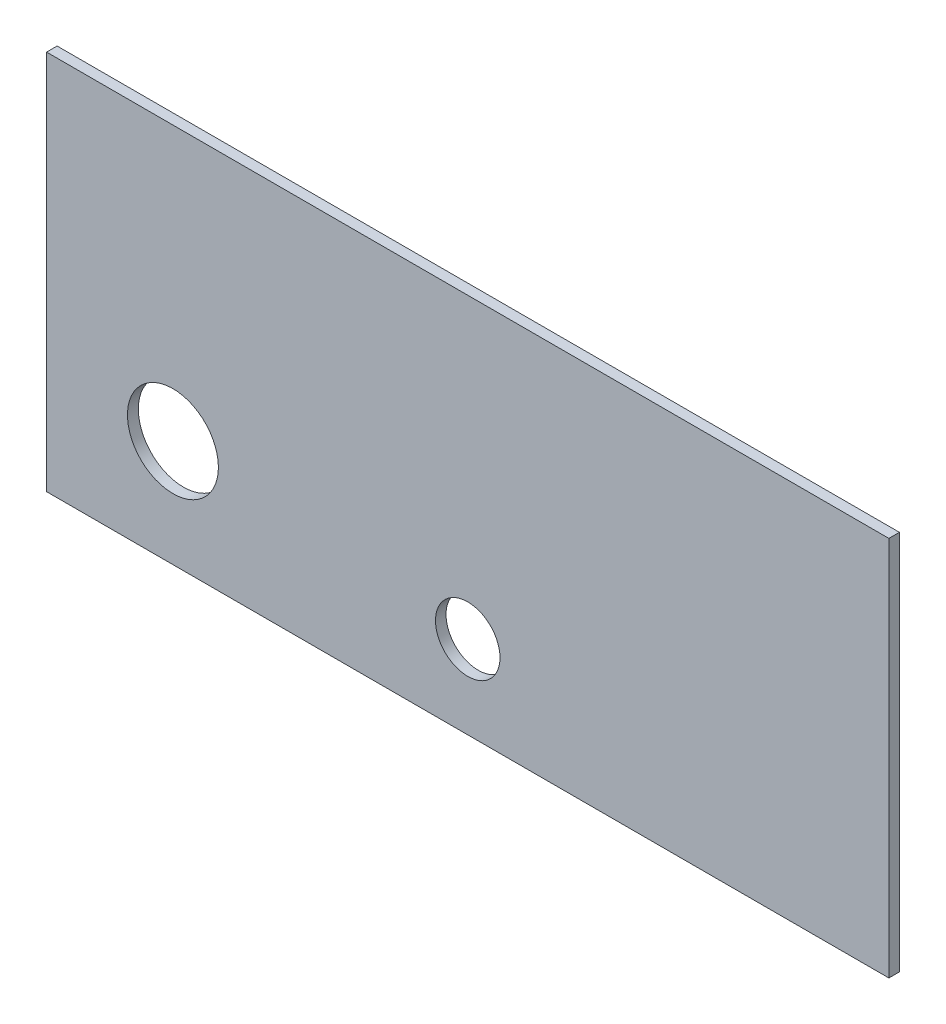
ISO-10303-21;
HEADER;
FILE_DESCRIPTION(('STEP AP214'),'2;1');
FILE_NAME('part.step','',(''),(''),'','','');
FILE_SCHEMA(('AUTOMOTIVE_DESIGN { 1 0 10303 214 1 1 1 1 }'));
ENDSEC;
DATA;
#1=APPLICATION_CONTEXT('core data for automotive mechanical design processes');
#2=APPLICATION_PROTOCOL_DEFINITION('international standard','automotive_design',2000,#1);
#3=PRODUCT_CONTEXT('',#1,'mechanical');
#4=PRODUCT('Part','Part','',(#3));
#5=PRODUCT_RELATED_PRODUCT_CATEGORY('part','',(#4));
#6=PRODUCT_DEFINITION_FORMATION('','',#4);
#7=PRODUCT_DEFINITION_CONTEXT('part definition',#1,'design');
#8=PRODUCT_DEFINITION('design','',#6,#7);
#9=PRODUCT_DEFINITION_SHAPE('','',#8);
#10=(LENGTH_UNIT() NAMED_UNIT(*) SI_UNIT(.MILLI.,.METRE.));
#11=(NAMED_UNIT(*) PLANE_ANGLE_UNIT() SI_UNIT($,.RADIAN.));
#12=(NAMED_UNIT(*) SI_UNIT($,.STERADIAN.) SOLID_ANGLE_UNIT());
#13=UNCERTAINTY_MEASURE_WITH_UNIT(LENGTH_MEASURE(1.E-05),#10,'distance_accuracy_value','');
#14=(GEOMETRIC_REPRESENTATION_CONTEXT(3) GLOBAL_UNCERTAINTY_ASSIGNED_CONTEXT((#13)) GLOBAL_UNIT_ASSIGNED_CONTEXT((#10,
#11,#12)) REPRESENTATION_CONTEXT('',''));
#15=CARTESIAN_POINT('',(0.,0.,0.));
#16=DIRECTION('',(0.,0.,1.));
#17=DIRECTION('',(1.,0.,0.));
#18=AXIS2_PLACEMENT_3D('',#15,#16,#17);
#19=CARTESIAN_POINT('',(0.,0.,-1.5875));
#20=DIRECTION('',(0.,0.,-1.));
#21=DIRECTION('',(-1.,0.,0.));
#22=AXIS2_PLACEMENT_3D('',#19,#20,#21);
#23=PLANE('',#22);
#24=CARTESIAN_POINT('',(19.05,16.129,-1.5875));
#25=DIRECTION('',(0.,0.,-1.));
#26=DIRECTION('',(-1.,0.,0.));
#27=AXIS2_PLACEMENT_3D('',#24,#25,#26);
#28=CIRCLE('',#27,6.80705182406678);
#29=CARTESIAN_POINT('',(12.2429481759332,16.129,-1.5875));
#30=VERTEX_POINT('',#29);
#31=EDGE_CURVE('E145',#30,#30,#28,.T.);
#32=ORIENTED_EDGE('',*,*,#31,.F.);
#33=EDGE_LOOP('',(#32));
#34=FACE_BOUND('',#33,.T.);
#35=DIRECTION('',(0.,-1.,0.));
#36=VECTOR('',#35,1.);
#37=CARTESIAN_POINT('',(0.,0.,-1.5875));
#38=LINE('',#37,#36);
#39=CARTESIAN_POINT('',(0.,57.404,-1.5875));
#40=VERTEX_POINT('',#39);
#41=CARTESIAN_POINT('',(0.,0.,-1.5875));
#42=VERTEX_POINT('',#41);
#43=EDGE_CURVE('E93',#40,#42,#38,.T.);
#44=ORIENTED_EDGE('',*,*,#43,.F.);
#45=DIRECTION('',(-1.,0.,0.));
#46=VECTOR('',#45,1.);
#47=CARTESIAN_POINT('',(0.,57.404,-1.5875));
#48=LINE('',#47,#46);
#49=CARTESIAN_POINT('',(127.,57.404,-1.5875));
#50=VERTEX_POINT('',#49);
#51=EDGE_CURVE('E90',#50,#40,#48,.T.);
#52=ORIENTED_EDGE('',*,*,#51,.F.);
#53=DIRECTION('',(0.,1.,0.));
#54=VECTOR('',#53,1.);
#55=CARTESIAN_POINT('',(127.,0.,-1.5875));
#56=LINE('',#55,#54);
#57=CARTESIAN_POINT('',(127.,0.,-1.5875));
#58=VERTEX_POINT('',#57);
#59=EDGE_CURVE('E83',#58,#50,#56,.T.);
#60=ORIENTED_EDGE('',*,*,#59,.F.);
#61=DIRECTION('',(1.,0.,0.));
#62=VECTOR('',#61,1.);
#63=CARTESIAN_POINT('',(0.,0.,-1.5875));
#64=LINE('',#63,#62);
#65=EDGE_CURVE('E89',#42,#58,#64,.T.);
#66=ORIENTED_EDGE('',*,*,#65,.F.);
#67=EDGE_LOOP('',(#44,#52,#60,#66));
#68=FACE_BOUND('',#67,.T.);
#69=CARTESIAN_POINT('',(63.5,12.500102,-1.5875));
#70=DIRECTION('',(0.,0.,1.));
#71=DIRECTION('',(1.,0.,0.));
#72=AXIS2_PLACEMENT_3D('',#69,#70,#71);
#73=CIRCLE('',#72,4.86400000000001);
#74=CARTESIAN_POINT('',(68.364,12.500102,-1.5875));
#75=VERTEX_POINT('',#74);
#76=EDGE_CURVE('E104',#75,#75,#73,.T.);
#77=ORIENTED_EDGE('',*,*,#76,.T.);
#78=EDGE_LOOP('',(#77));
#79=FACE_BOUND('',#78,.T.);
#80=ADVANCED_FACE('F34',(#34,#68,#79),#23,.T.);
#81=CARTESIAN_POINT('',(0.,0.,-1.5875));
#82=DIRECTION('',(-1.,0.,0.));
#83=DIRECTION('',(0.,0.,1.));
#84=AXIS2_PLACEMENT_3D('',#81,#82,#83);
#85=PLANE('',#84);
#86=DIRECTION('',(0.,-1.,0.));
#87=VECTOR('',#86,1.);
#88=CARTESIAN_POINT('',(0.,0.,0.));
#89=LINE('',#88,#87);
#90=CARTESIAN_POINT('',(0.,57.404,0.));
#91=VERTEX_POINT('',#90);
#92=CARTESIAN_POINT('',(0.,0.,0.));
#93=VERTEX_POINT('',#92);
#94=EDGE_CURVE('E100',#91,#93,#89,.T.);
#95=ORIENTED_EDGE('',*,*,#94,.F.);
#96=DIRECTION('',(0.,0.,1.));
#97=VECTOR('',#96,1.);
#98=CARTESIAN_POINT('',(0.,57.404,-1.5875));
#99=LINE('',#98,#97);
#100=EDGE_CURVE('E11',#40,#91,#99,.T.);
#101=ORIENTED_EDGE('',*,*,#100,.F.);
#102=ORIENTED_EDGE('',*,*,#43,.T.);
#103=DIRECTION('',(0.,0.,1.));
#104=VECTOR('',#103,1.);
#105=CARTESIAN_POINT('',(0.,0.,-1.5875));
#106=LINE('',#105,#104);
#107=EDGE_CURVE('E38',#42,#93,#106,.T.);
#108=ORIENTED_EDGE('',*,*,#107,.T.);
#109=EDGE_LOOP('',(#95,#101,#102,#108));
#110=FACE_BOUND('',#109,.T.);
#111=ADVANCED_FACE('F36',(#110),#85,.T.);
#112=CARTESIAN_POINT('',(0.,57.404,-1.5875));
#113=DIRECTION('',(0.,1.,0.));
#114=DIRECTION('',(0.,0.,1.));
#115=AXIS2_PLACEMENT_3D('',#112,#113,#114);
#116=PLANE('',#115);
#117=DIRECTION('',(-1.,0.,0.));
#118=VECTOR('',#117,1.);
#119=CARTESIAN_POINT('',(0.,57.404,0.));
#120=LINE('',#119,#118);
#121=CARTESIAN_POINT('',(127.,57.404,0.));
#122=VERTEX_POINT('',#121);
#123=EDGE_CURVE('E95',#122,#91,#120,.T.);
#124=ORIENTED_EDGE('',*,*,#123,.F.);
#125=DIRECTION('',(0.,0.,1.));
#126=VECTOR('',#125,1.);
#127=CARTESIAN_POINT('',(127.,57.404,-1.5875));
#128=LINE('',#127,#126);
#129=EDGE_CURVE('E44',#50,#122,#128,.T.);
#130=ORIENTED_EDGE('',*,*,#129,.F.);
#131=ORIENTED_EDGE('',*,*,#51,.T.);
#132=ORIENTED_EDGE('',*,*,#100,.T.);
#133=EDGE_LOOP('',(#124,#130,#131,#132));
#134=FACE_BOUND('',#133,.T.);
#135=ADVANCED_FACE('F111',(#134),#116,.T.);
#136=CARTESIAN_POINT('',(127.,0.,-1.5875));
#137=DIRECTION('',(1.,0.,0.));
#138=DIRECTION('',(0.,0.,-1.));
#139=AXIS2_PLACEMENT_3D('',#136,#137,#138);
#140=PLANE('',#139);
#141=DIRECTION('',(0.,1.,0.));
#142=VECTOR('',#141,1.);
#143=CARTESIAN_POINT('',(127.,0.,0.));
#144=LINE('',#143,#142);
#145=CARTESIAN_POINT('',(127.,0.,0.));
#146=VERTEX_POINT('',#145);
#147=EDGE_CURVE('E85',#146,#122,#144,.T.);
#148=ORIENTED_EDGE('',*,*,#147,.F.);
#149=DIRECTION('',(0.,0.,1.));
#150=VECTOR('',#149,1.);
#151=CARTESIAN_POINT('',(127.,0.,-1.5875));
#152=LINE('',#151,#150);
#153=EDGE_CURVE('E80',#58,#146,#152,.T.);
#154=ORIENTED_EDGE('',*,*,#153,.F.);
#155=ORIENTED_EDGE('',*,*,#59,.T.);
#156=ORIENTED_EDGE('',*,*,#129,.T.);
#157=EDGE_LOOP('',(#148,#154,#155,#156));
#158=FACE_BOUND('',#157,.T.);
#159=ADVANCED_FACE('F82',(#158),#140,.T.);
#160=CARTESIAN_POINT('',(0.,0.,-1.5875));
#161=DIRECTION('',(0.,-1.,0.));
#162=DIRECTION('',(0.,0.,-1.));
#163=AXIS2_PLACEMENT_3D('',#160,#161,#162);
#164=PLANE('',#163);
#165=DIRECTION('',(1.,0.,0.));
#166=VECTOR('',#165,1.);
#167=CARTESIAN_POINT('',(0.,0.,0.));
#168=LINE('',#167,#166);
#169=EDGE_CURVE('E103',#93,#146,#168,.T.);
#170=ORIENTED_EDGE('',*,*,#169,.F.);
#171=ORIENTED_EDGE('',*,*,#107,.F.);
#172=ORIENTED_EDGE('',*,*,#65,.T.);
#173=ORIENTED_EDGE('',*,*,#153,.T.);
#174=EDGE_LOOP('',(#170,#171,#172,#173));
#175=FACE_BOUND('',#174,.T.);
#176=ADVANCED_FACE('F92',(#175),#164,.T.);
#177=CARTESIAN_POINT('',(0.,0.,0.));
#178=DIRECTION('',(0.,0.,-1.));
#179=DIRECTION('',(-1.,0.,0.));
#180=AXIS2_PLACEMENT_3D('',#177,#178,#179);
#181=PLANE('',#180);
#182=CARTESIAN_POINT('',(19.05,16.129,0.));
#183=DIRECTION('',(0.,0.,1.));
#184=DIRECTION('',(1.,0.,0.));
#185=AXIS2_PLACEMENT_3D('',#182,#183,#184);
#186=CIRCLE('',#185,6.8545837);
#187=CARTESIAN_POINT('',(25.9045837,16.129,0.));
#188=VERTEX_POINT('',#187);
#189=EDGE_CURVE('E140',#188,#188,#186,.T.);
#190=ORIENTED_EDGE('',*,*,#189,.F.);
#191=EDGE_LOOP('',(#190));
#192=FACE_BOUND('',#191,.T.);
#193=CARTESIAN_POINT('',(63.5,12.500102,0.));
#194=DIRECTION('',(0.,0.,1.));
#195=DIRECTION('',(1.,0.,0.));
#196=AXIS2_PLACEMENT_3D('',#193,#194,#195);
#197=CIRCLE('',#196,4.86400000000001);
#198=CARTESIAN_POINT('',(68.364,12.500102,0.));
#199=VERTEX_POINT('',#198);
#200=EDGE_CURVE('E143',#199,#199,#197,.T.);
#201=ORIENTED_EDGE('',*,*,#200,.F.);
#202=EDGE_LOOP('',(#201));
#203=FACE_BOUND('',#202,.T.);
#204=ORIENTED_EDGE('',*,*,#94,.T.);
#205=ORIENTED_EDGE('',*,*,#169,.T.);
#206=ORIENTED_EDGE('',*,*,#147,.T.);
#207=ORIENTED_EDGE('',*,*,#123,.T.);
#208=EDGE_LOOP('',(#204,#205,#206,#207));
#209=FACE_BOUND('',#208,.T.);
#210=ADVANCED_FACE('F110',(#192,#203,#209),#181,.F.);
#211=CARTESIAN_POINT('',(63.5,12.500102,-1.5875));
#212=DIRECTION('',(0.,0.,1.));
#213=DIRECTION('',(1.,0.,0.));
#214=AXIS2_PLACEMENT_3D('',#211,#212,#213);
#215=CYLINDRICAL_SURFACE('',#214,4.86400000000001);
#216=ORIENTED_EDGE('',*,*,#76,.F.);
#217=EDGE_LOOP('',(#216));
#218=FACE_BOUND('',#217,.T.);
#219=ORIENTED_EDGE('',*,*,#200,.T.);
#220=EDGE_LOOP('',(#219));
#221=FACE_BOUND('',#220,.T.);
#222=ADVANCED_FACE('F127',(#218,#221),#215,.F.);
#223=CARTESIAN_POINT('',(19.05,16.129,0.));
#224=DIRECTION('',(0.,0.,1.));
#225=DIRECTION('',(1.,0.,0.));
#226=AXIS2_PLACEMENT_3D('',#223,#224,#225);
#227=CONICAL_SURFACE('',#226,6.8545837,0.0299323966717025);
#228=ORIENTED_EDGE('',*,*,#31,.T.);
#229=EDGE_LOOP('',(#228));
#230=FACE_BOUND('',#229,.T.);
#231=ORIENTED_EDGE('',*,*,#189,.T.);
#232=EDGE_LOOP('',(#231));
#233=FACE_BOUND('',#232,.T.);
#234=ADVANCED_FACE('F135',(#230,#233),#227,.F.);
#235=CLOSED_SHELL('',(#80,#111,#135,#159,#176,#210,#222,#234));
#236=MANIFOLD_SOLID_BREP('B2',#235);
#237=ADVANCED_BREP_SHAPE_REPRESENTATION('',(#18,#236),#14);
#238=SHAPE_DEFINITION_REPRESENTATION(#9,#237);
ENDSEC;
END-ISO-10303-21;
